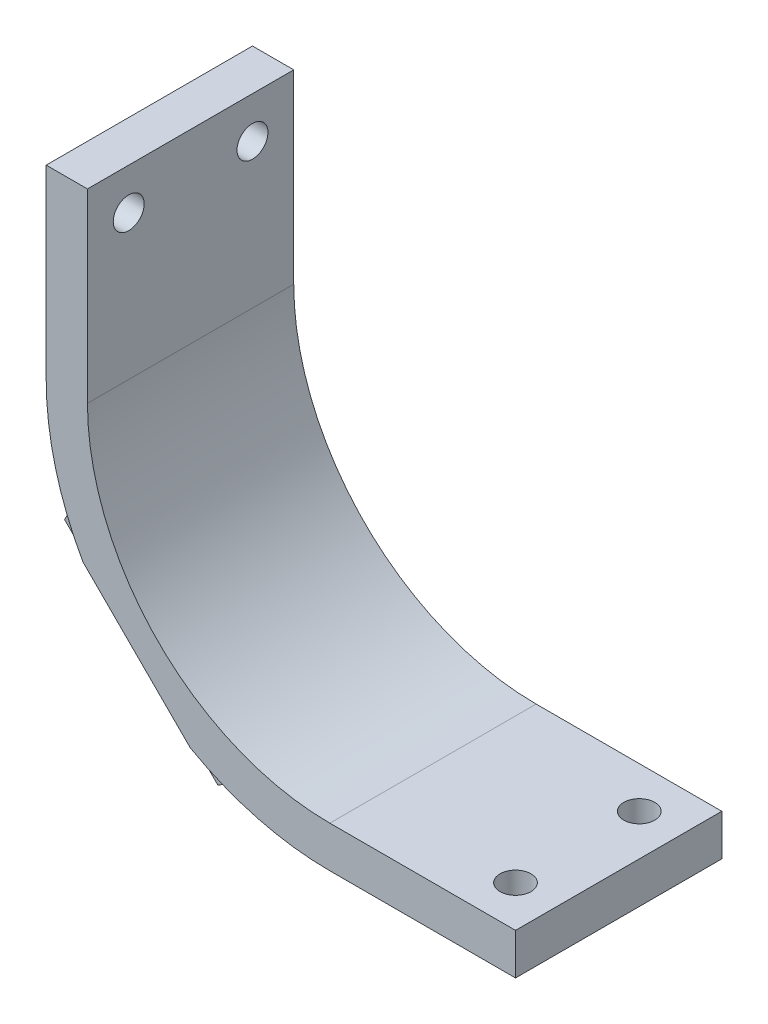
ISO-10303-21;
HEADER;
FILE_DESCRIPTION(('STEP AP214'),'2;1');
FILE_NAME('part.step','',(''),(''),'','','');
FILE_SCHEMA(('AUTOMOTIVE_DESIGN { 1 0 10303 214 1 1 1 1 }'));
ENDSEC;
DATA;
#1=APPLICATION_CONTEXT('core data for automotive mechanical design processes');
#2=APPLICATION_PROTOCOL_DEFINITION('international standard','automotive_design',2000,#1);
#3=PRODUCT_CONTEXT('',#1,'mechanical');
#4=PRODUCT('Part','Part','',(#3));
#5=PRODUCT_RELATED_PRODUCT_CATEGORY('part','',(#4));
#6=PRODUCT_DEFINITION_FORMATION('','',#4);
#7=PRODUCT_DEFINITION_CONTEXT('part definition',#1,'design');
#8=PRODUCT_DEFINITION('design','',#6,#7);
#9=PRODUCT_DEFINITION_SHAPE('','',#8);
#10=(LENGTH_UNIT() NAMED_UNIT(*) SI_UNIT(.MILLI.,.METRE.));
#11=(NAMED_UNIT(*) PLANE_ANGLE_UNIT() SI_UNIT($,.RADIAN.));
#12=(NAMED_UNIT(*) SI_UNIT($,.STERADIAN.) SOLID_ANGLE_UNIT());
#13=UNCERTAINTY_MEASURE_WITH_UNIT(LENGTH_MEASURE(1.E-05),#10,'distance_accuracy_value','');
#14=(GEOMETRIC_REPRESENTATION_CONTEXT(3) GLOBAL_UNCERTAINTY_ASSIGNED_CONTEXT((#13)) GLOBAL_UNIT_ASSIGNED_CONTEXT((#10,
#11,#12)) REPRESENTATION_CONTEXT('',''));
#15=CARTESIAN_POINT('',(0.,0.,0.));
#16=DIRECTION('',(0.,0.,1.));
#17=DIRECTION('',(1.,0.,0.));
#18=AXIS2_PLACEMENT_3D('',#15,#16,#17);
#19=CARTESIAN_POINT('',(47.,47.,40.));
#20=DIRECTION('',(0.,0.,-1.));
#21=DIRECTION('',(-1.,0.,0.));
#22=AXIS2_PLACEMENT_3D('',#19,#20,#21);
#23=CYLINDRICAL_SURFACE('',#22,55.);
#24=CARTESIAN_POINT('',(47.,47.,40.));
#25=DIRECTION('',(0.,0.,1.));
#26=DIRECTION('',(1.,0.,0.));
#27=AXIS2_PLACEMENT_3D('',#24,#25,#26);
#28=CIRCLE('',#27,55.);
#29=CARTESIAN_POINT('',(19.9156454425262,-0.868964248300269,40.));
#30=VERTEX_POINT('',#29);
#31=CARTESIAN_POINT('',(47.,-8.,40.));
#32=VERTEX_POINT('',#31);
#33=EDGE_CURVE('E253',#30,#32,#28,.T.);
#34=ORIENTED_EDGE('',*,*,#33,.F.);
#35=DIRECTION('',(0.,0.,-1.));
#36=VECTOR('',#35,1.);
#37=CARTESIAN_POINT('',(19.9156454425263,-0.868964248300295,40.));
#38=LINE('',#37,#36);
#39=CARTESIAN_POINT('',(19.9156454425262,-0.868964248300282,13.0000000000001));
#40=VERTEX_POINT('',#39);
#41=EDGE_CURVE('E184',#30,#40,#38,.T.);
#42=ORIENTED_EDGE('',*,*,#41,.T.);
#43=CARTESIAN_POINT('',(47.,47.,13.0000000000001));
#44=DIRECTION('',(0.,0.,-1.));
#45=DIRECTION('',(-1.,0.,0.));
#46=AXIS2_PLACEMENT_3D('',#43,#44,#45);
#47=CIRCLE('',#46,55.);
#48=CARTESIAN_POINT('',(47.,-8.,13.0000000000001));
#49=VERTEX_POINT('',#48);
#50=EDGE_CURVE('E304',#40,#49,#47,.F.);
#51=ORIENTED_EDGE('',*,*,#50,.T.);
#52=DIRECTION('',(0.,0.,-1.));
#53=VECTOR('',#52,1.);
#54=CARTESIAN_POINT('',(47.,-8.,40.));
#55=LINE('',#54,#53);
#56=EDGE_CURVE('E301',#32,#49,#55,.T.);
#57=ORIENTED_EDGE('',*,*,#56,.F.);
#58=EDGE_LOOP('',(#34,#42,#51,#57));
#59=FACE_BOUND('',#58,.T.);
#60=ADVANCED_FACE('F34',(#59),#23,.T.);
#61=CARTESIAN_POINT('',(47.,47.,13.0000000000001));
#62=DIRECTION('',(0.,0.,-1.));
#63=DIRECTION('',(-1.,0.,0.));
#64=AXIS2_PLACEMENT_3D('',#61,#62,#63);
#65=CONICAL_SURFACE('',#64,55.,0.785398163397444);
#66=CARTESIAN_POINT('',(47.,47.,8.));
#67=DIRECTION('',(0.,0.,-1.));
#68=DIRECTION('',(-1.,0.,0.));
#69=AXIS2_PLACEMENT_3D('',#66,#67,#68);
#70=CIRCLE('',#69,60.);
#71=CARTESIAN_POINT('',(-8.02785789808516,23.0848404741229,8.));
#72=VERTEX_POINT('',#71);
#73=CARTESIAN_POINT('',(-12.4166791817191,38.65384908975,8.));
#74=VERTEX_POINT('',#73);
#75=EDGE_CURVE('E308',#72,#74,#70,.T.);
#76=ORIENTED_EDGE('',*,*,#75,.F.);
#77=CARTESIAN_POINT('',(-8.02800990642339,23.0846884657847,7.9998));
#78=CARTESIAN_POINT('',(-7.69603661450025,23.4166617577078,8.43662037748966));
#79=CARTESIAN_POINT('',(-7.36378319515066,23.7489151770574,8.87301341968575));
#80=CARTESIAN_POINT('',(-6.6987160893605,24.4139822828476,9.74494484953542));
#81=CARTESIAN_POINT('',(-6.36590240289932,24.7467959693088,10.1804832371575));
#82=CARTESIAN_POINT('',(-6.03280858899107,25.079889783217,10.6155942894546));
#83=B_SPLINE_CURVE_WITH_KNOTS('',3,(#77,#78,#79,#80,#81,#82),.UNSPECIFIED.,.F.,.F.,(4,2,4),(0.,
1.923801447537,3.84760296587459),.UNSPECIFIED.);
#84=CARTESIAN_POINT('',(-6.03300858899107,25.079689783217,10.6153330583857));
#85=VERTEX_POINT('',#84);
#86=EDGE_CURVE('E11',#72,#85,#83,.T.);
#87=ORIENTED_EDGE('',*,*,#86,.T.);
#88=CARTESIAN_POINT('',(-32.6031163795725,51.6497975737985,-11.7388033194447));
#89=CARTESIAN_POINT('',(-32.0640904072059,51.1107716014319,-11.1692792117739));
#90=CARTESIAN_POINT('',(-31.523434261238,50.5701154554639,-10.6028292409363));
#91=CARTESIAN_POINT('',(-30.4385887826844,49.4852699769104,-9.47670280810827));
#92=CARTESIAN_POINT('',(-29.8943993720311,48.9410805662571,-8.9170264965704));
#93=CARTESIAN_POINT('',(-28.8020721211141,47.84875331534,-7.80492863635069));
#94=CARTESIAN_POINT('',(-28.2539331290096,47.3006143232355,-7.25250934864027));
#95=CARTESIAN_POINT('',(-27.1535847874001,46.2002659816261,-6.15584226000236));
#96=CARTESIAN_POINT('',(-26.6013754584182,45.6480566526442,-5.61159441791556));
#97=CARTESIAN_POINT('',(-25.487151272393,44.533832466619,-4.52681799322916));
#98=CARTESIAN_POINT('',(-24.9250933351123,43.9717745293382,-3.9863778398094));
#99=CARTESIAN_POINT('',(-23.7961668918426,42.8428480860685,-2.91564373066713));
#100=CARTESIAN_POINT('',(-23.2292984154502,42.2759796096761,-2.38534971258647));
#101=CARTESIAN_POINT('',(-22.0904139146043,41.1370951088303,-1.33603458546711));
#102=CARTESIAN_POINT('',(-21.5183982147383,40.5650794089642,-0.817012772544337));
#103=CARTESIAN_POINT('',(-20.3688033625842,39.4154845568101,0.20853521996653));
#104=CARTESIAN_POINT('',(-19.791224318911,38.8379055131369,0.715061642821188));
#105=CARTESIAN_POINT('',(-18.5984799718122,37.6451611660381,1.74140428688366));
#106=CARTESIAN_POINT('',(-17.982979822515,37.029661016741,2.26044351499154));
#107=CARTESIAN_POINT('',(-16.744816046082,35.791497240308,3.28117704252352));
#108=CARTESIAN_POINT('',(-16.1221523897576,35.1688335839836,3.78287127124005));
#109=CARTESIAN_POINT('',(-14.8690127209983,33.9156939152242,4.76685558098336));
#110=CARTESIAN_POINT('',(-14.2385350372513,33.2852162314773,5.24914141376239));
#111=CARTESIAN_POINT('',(-12.9694056522147,32.0160868464407,6.19171564118395));
#112=CARTESIAN_POINT('',(-12.3307540158984,31.3774352101243,6.65200421054131));
#113=CARTESIAN_POINT('',(-11.0472211779615,30.0939023721874,7.54609543564553));
#114=CARTESIAN_POINT('',(-10.4023728789115,29.4490540731374,7.9799921080813));
#115=CARTESIAN_POINT('',(-9.1037273058817,28.1504085001077,8.82003346191691));
#116=CARTESIAN_POINT('',(-8.44992975974284,27.4966109539688,9.22617729705363));
#117=CARTESIAN_POINT('',(-6.47516757696274,25.5218487711887,10.3974920887747));
#118=CARTESIAN_POINT('',(-5.13995178297837,24.1866329772043,11.1161703975154));
#119=CARTESIAN_POINT('',(-3.14941241288739,22.1960936071134,12.0582721611732));
#120=CARTESIAN_POINT('',(-2.50828573668544,21.5549669309114,12.3424931449902));
#121=CARTESIAN_POINT('',(-1.21817271561682,20.2648539098428,12.87288798258));
#122=CARTESIAN_POINT('',(-0.569186715612083,19.615867909838,13.1190634992864));
#123=CARTESIAN_POINT('',(0.736052472034867,18.3106287221911,13.5699358560089));
#124=CARTESIAN_POINT('',(1.39230649558333,17.6543746986426,13.7746278715835));
#125=CARTESIAN_POINT('',(2.71103610635231,16.3356450878736,14.1392641562665));
#126=CARTESIAN_POINT('',(3.37351169512802,15.6731694990979,14.2992084141892));
#127=CARTESIAN_POINT('',(4.69084996641715,14.3558312278088,14.568992498867));
#128=CARTESIAN_POINT('',(5.34562159760193,13.701059596624,14.6797178311156));
#129=CARTESIAN_POINT('',(6.65833612574721,12.3883450684788,14.8533863384364));
#130=CARTESIAN_POINT('',(7.31627898503298,11.730402209193,14.9163300797609));
#131=CARTESIAN_POINT('',(8.6335607759349,10.4131204182911,14.9932327749022));
#132=CARTESIAN_POINT('',(9.29289961730351,9.75378157692245,15.0071948040324));
#133=CARTESIAN_POINT('',(10.6111786778843,8.43550251634171,14.9858702361388));
#134=CARTESIAN_POINT('',(11.2701188959945,7.77656229823148,14.9505835035933));
#135=CARTESIAN_POINT('',(12.5853641779881,6.46131701623786,14.8314841555602));
#136=CARTESIAN_POINT('',(13.2416706666149,5.80501052761108,14.7477028323068));
#137=CARTESIAN_POINT('',(14.5504193597358,4.49626183449021,14.533206320363));
#138=CARTESIAN_POINT('',(15.2028615509743,3.8438196432517,14.402490970771));
#139=CARTESIAN_POINT('',(16.5025569914353,2.54412420279068,14.0964054891875));
#140=CARTESIAN_POINT('',(17.1498094859265,1.89687170829942,13.9210289794581));
#141=CARTESIAN_POINT('',(18.4379195085917,0.608761685634254,13.5284642291873));
#142=CARTESIAN_POINT('',(19.0787769727516,-0.0320957785256306,13.3112755705485));
#143=CARTESIAN_POINT('',(20.3651423751899,-1.31846118096395,12.8338456886665));
#144=CARTESIAN_POINT('',(21.0105151596011,-1.96383396537509,12.5728789326895));
#145=CARTESIAN_POINT('',(22.2932907376685,-3.24660954344254,12.0143022460322));
#146=CARTESIAN_POINT('',(22.9306930559293,-3.88401186170331,11.7166901410286));
#147=CARTESIAN_POINT('',(24.1971649820708,-5.1504837878448,11.0883232832366));
#148=CARTESIAN_POINT('',(24.8262355836341,-5.7795543894081,10.7575725237734));
#149=CARTESIAN_POINT('',(26.076092968643,-7.02941177441705,10.0661949575039));
#150=CARTESIAN_POINT('',(26.6968795359541,-7.65019834172814,9.70556737295925));
#151=CARTESIAN_POINT('',(28.4363099284002,-9.38962873417419,8.65067817098942));
#152=CARTESIAN_POINT('',(29.5455870289438,-10.4989058347178,7.92541817562292));
#153=CARTESIAN_POINT('',(31.7390513972084,-12.6923702029824,6.40252232829223));
#154=CARTESIAN_POINT('',(32.8232329381816,-13.7765517439557,5.60487015702447));
#155=CARTESIAN_POINT('',(34.9705153850231,-15.9238341907972,3.94927936246574));
#156=CARTESIAN_POINT('',(36.0335791612341,-16.9868979670081,3.09124485488133));
#157=CARTESIAN_POINT('',(38.1392646440706,-19.0925834498446,1.32688858141707));
#158=CARTESIAN_POINT('',(39.1818880226671,-20.1352068284411,0.420570787717988));
#159=CARTESIAN_POINT('',(41.198023451476,-22.15134225725,-1.38599371980204));
#160=CARTESIAN_POINT('',(42.172400444719,-23.125719250493,-2.28431686551629));
#161=CARTESIAN_POINT('',(44.1069418778061,-25.0602606835802,-4.11112352728949));
#162=CARTESIAN_POINT('',(45.0671056746427,-26.0204244804168,-5.03960840183673));
#163=CARTESIAN_POINT('',(46.9706855674543,-27.9240043732283,-6.91783234761778));
#164=CARTESIAN_POINT('',(47.9141567726069,-28.8674755783809,-7.867459896317));
#165=CARTESIAN_POINT('',(49.3210494636857,-30.2743682694597,-9.30786712267713));
#166=CARTESIAN_POINT('',(49.7885920681769,-30.7419108739509,-9.79062578750839));
#167=CARTESIAN_POINT('',(50.721091178109,-31.674409983883,-10.7610953996489));
#168=CARTESIAN_POINT('',(51.1860477181062,-32.1393665238802,-11.248806280537));
#169=CARTESIAN_POINT('',(51.6497975737985,-32.6031163795725,-11.7388033194447));
#170=B_SPLINE_CURVE_WITH_KNOTS('',3,(#88,#89,#90,#91,#92,#93,#94,#95,#96,#97,#98,#99,#100,#101,
#102,#103,#104,#105,#106,#107,#108,#109,#110,#111,#112,#113,#114,#115,#116,#117,#118,#119,#120,
#121,#122,#123,#124,#125,#126,#127,#128,#129,#130,#131,#132,#133,#134,#135,#136,#137,#138,#139,
#140,#141,#142,#143,#144,#145,#146,#147,#148,#149,#150,#151,#152,#153,#154,#155,#156,#157,#158,
#159,#160,#161,#162,#163,#164,#165,#166,#167,#168,#169),.UNSPECIFIED.,.F.,.F.,(4,2,2,2,2,2,2,2,
2,2,2,2,2,2,2,2,2,2,2,2,2,2,2,2,2,2,2,2,2,2,2,2,2,2,2,2,2,2,2,2,4),(0.,2.854665627318,
5.70939454482451,8.56499272833419,11.4205765234581,14.3040876074017,17.1875809635913,
20.0708937415538,22.9541503413566,25.9943225502353,29.0345071510345,32.0753536291279,
35.1161759510678,38.1454409279422,41.1747982345577,47.229336758417,50.079275638274,
52.9290899145731,55.7792354281715,58.6293816542353,61.425940419648,64.2224660429604,
67.0188160834684,69.8151738189271,72.6097291495406,75.4042940606901,78.1992582674927,
80.9942504237806,83.8412209326692,86.6883604458117,89.5351572802687,92.3820282444118,
97.5643879281655,102.747918782292,107.939875130006,113.131405002251,118.065744391249,
123.000306332536,127.913151404862,130.369192994932,132.825201686932),.UNSPECIFIED.);
#171=CARTESIAN_POINT('',(-0.868964248300283,19.9156454425262,13.0000000000001));
#172=VERTEX_POINT('',#171);
#173=EDGE_CURVE('E44',#85,#172,#170,.T.);
#174=ORIENTED_EDGE('',*,*,#173,.T.);
#175=CARTESIAN_POINT('',(-8.,47.,13.0000000000001));
#176=VERTEX_POINT('',#175);
#177=EDGE_CURVE('E305',#176,#172,#47,.F.);
#178=ORIENTED_EDGE('',*,*,#177,.F.);
#179=CARTESIAN_POINT('',(-12.4166791817191,38.65384908975,8.));
#180=CARTESIAN_POINT('',(-12.0571719483686,39.3332060227347,8.45047450478482));
#181=CARTESIAN_POINT('',(-11.6956859904717,40.0163021301069,8.89380872091933));
#182=CARTESIAN_POINT('',(-10.9686773957215,41.3901224134429,9.76407680964662));
#183=CARTESIAN_POINT('',(-10.603157014587,42.0808423267993,10.1910193029875));
#184=CARTESIAN_POINT('',(-9.86759038414573,43.470834637678,11.0268994642175));
#185=CARTESIAN_POINT('',(-9.49754380373565,44.1701076608823,11.4358358047221));
#186=CARTESIAN_POINT('',(-8.75250109029604,45.5780068233768,12.2336202180553));
#187=CARTESIAN_POINT('',(-8.37750242052765,46.2866377563149,12.622457450749));
#188=CARTESIAN_POINT('',(-8.,47.,13.0000000000001));
#189=B_SPLINE_CURVE_WITH_KNOTS('',3,(#179,#180,#181,#182,#183,#184,#185,#186,#187,#188),
.UNSPECIFIED.,.F.,.F.,(4,2,2,2,4),(0.,2.67271079094445,5.34399613576452,8.01547807484035,
10.6883861152924),.UNSPECIFIED.);
#190=EDGE_CURVE('E315',#74,#176,#189,.T.);
#191=ORIENTED_EDGE('',*,*,#190,.F.);
#192=EDGE_LOOP('',(#76,#87,#174,#178,#191));
#193=FACE_BOUND('',#192,.T.);
#194=ADVANCED_FACE('F365',(#193),#65,.T.);
#195=ORIENTED_EDGE('',*,*,#177,.T.);
#196=DIRECTION('',(0.,0.,-1.));
#197=VECTOR('',#196,1.);
#198=CARTESIAN_POINT('',(-0.868964248300295,19.9156454425263,40.));
#199=LINE('',#198,#197);
#200=CARTESIAN_POINT('',(-0.868964248300262,19.9156454425262,40.));
#201=VERTEX_POINT('',#200);
#202=EDGE_CURVE('E188',#172,#201,#199,.F.);
#203=ORIENTED_EDGE('',*,*,#202,.T.);
#204=CARTESIAN_POINT('',(-8.,47.,40.));
#205=VERTEX_POINT('',#204);
#206=EDGE_CURVE('E249',#205,#201,#28,.T.);
#207=ORIENTED_EDGE('',*,*,#206,.F.);
#208=DIRECTION('',(0.,0.,-1.));
#209=VECTOR('',#208,1.);
#210=CARTESIAN_POINT('',(-8.,47.,40.));
#211=LINE('',#210,#209);
#212=EDGE_CURVE('E267',#205,#176,#211,.T.);
#213=ORIENTED_EDGE('',*,*,#212,.T.);
#214=EDGE_LOOP('',(#195,#203,#207,#213));
#215=FACE_BOUND('',#214,.T.);
#216=ADVANCED_FACE('F362',(#215),#23,.T.);
#217=CARTESIAN_POINT('',(47.,-8.,40.));
#218=DIRECTION('',(0.,1.,0.));
#219=DIRECTION('',(0.,0.,1.));
#220=AXIS2_PLACEMENT_3D('',#217,#218,#219);
#221=PLANE('',#220);
#222=CARTESIAN_POINT('',(75.,-8.,32.));
#223=DIRECTION('',(0.,-1.,0.));
#224=DIRECTION('',(0.,0.,-1.));
#225=AXIS2_PLACEMENT_3D('',#222,#223,#224);
#226=CIRCLE('',#225,3.00000000000001);
#227=CARTESIAN_POINT('',(75.,-8.,29.));
#228=VERTEX_POINT('',#227);
#229=EDGE_CURVE('E682',#228,#228,#226,.T.);
#230=ORIENTED_EDGE('',*,*,#229,.F.);
#231=EDGE_LOOP('',(#230));
#232=FACE_BOUND('',#231,.T.);
#233=CARTESIAN_POINT('',(75.,-8.,8.));
#234=DIRECTION('',(0.,-1.,0.));
#235=DIRECTION('',(0.,0.,-1.));
#236=AXIS2_PLACEMENT_3D('',#233,#234,#235);
#237=CIRCLE('',#236,3.00000000000001);
#238=CARTESIAN_POINT('',(75.,-8.,4.99999999999999));
#239=VERTEX_POINT('',#238);
#240=EDGE_CURVE('E684',#239,#239,#237,.T.);
#241=ORIENTED_EDGE('',*,*,#240,.F.);
#242=EDGE_LOOP('',(#241));
#243=FACE_BOUND('',#242,.T.);
#244=DIRECTION('',(1.,0.,0.));
#245=VECTOR('',#244,1.);
#246=CARTESIAN_POINT('',(47.,-8.,0.));
#247=LINE('',#246,#245);
#248=CARTESIAN_POINT('',(47.,-8.,0.));
#249=VERTEX_POINT('',#248);
#250=CARTESIAN_POINT('',(83.,-8.,0.));
#251=VERTEX_POINT('',#250);
#252=EDGE_CURVE('E242',#249,#251,#247,.T.);
#253=ORIENTED_EDGE('',*,*,#252,.T.);
#254=DIRECTION('',(0.,0.,-1.));
#255=VECTOR('',#254,1.);
#256=CARTESIAN_POINT('',(83.,-8.,40.));
#257=LINE('',#256,#255);
#258=CARTESIAN_POINT('',(83.,-8.,40.));
#259=VERTEX_POINT('',#258);
#260=EDGE_CURVE('E298',#259,#251,#257,.T.);
#261=ORIENTED_EDGE('',*,*,#260,.F.);
#262=DIRECTION('',(1.,0.,0.));
#263=VECTOR('',#262,1.);
#264=CARTESIAN_POINT('',(47.,-8.,40.));
#265=LINE('',#264,#263);
#266=EDGE_CURVE('E252',#32,#259,#265,.T.);
#267=ORIENTED_EDGE('',*,*,#266,.F.);
#268=ORIENTED_EDGE('',*,*,#56,.T.);
#269=DIRECTION('',(0.,0.,-1.));
#270=VECTOR('',#269,1.);
#271=CARTESIAN_POINT('',(47.,-8.,8.));
#272=LINE('',#271,#270);
#273=EDGE_CURVE('E231',#49,#249,#272,.T.);
#274=ORIENTED_EDGE('',*,*,#273,.T.);
#275=EDGE_LOOP('',(#253,#261,#267,#268,#274));
#276=FACE_BOUND('',#275,.T.);
#277=ADVANCED_FACE('F359',(#232,#243,#276),#221,.F.);
#278=CARTESIAN_POINT('',(83.,0.,40.));
#279=DIRECTION('',(-1.,0.,0.));
#280=DIRECTION('',(0.,0.,1.));
#281=AXIS2_PLACEMENT_3D('',#278,#279,#280);
#282=PLANE('',#281);
#283=DIRECTION('',(0.,1.,0.));
#284=VECTOR('',#283,1.);
#285=CARTESIAN_POINT('',(83.,0.,0.));
#286=LINE('',#285,#284);
#287=CARTESIAN_POINT('',(83.,0.,0.));
#288=VERTEX_POINT('',#287);
#289=EDGE_CURVE('E269',#251,#288,#286,.T.);
#290=ORIENTED_EDGE('',*,*,#289,.T.);
#291=DIRECTION('',(0.,0.,-1.));
#292=VECTOR('',#291,1.);
#293=CARTESIAN_POINT('',(83.,0.,40.));
#294=LINE('',#293,#292);
#295=CARTESIAN_POINT('',(83.,0.,40.));
#296=VERTEX_POINT('',#295);
#297=EDGE_CURVE('E295',#296,#288,#294,.T.);
#298=ORIENTED_EDGE('',*,*,#297,.F.);
#299=DIRECTION('',(0.,1.,0.));
#300=VECTOR('',#299,1.);
#301=CARTESIAN_POINT('',(83.,0.,40.));
#302=LINE('',#301,#300);
#303=EDGE_CURVE('E255',#259,#296,#302,.T.);
#304=ORIENTED_EDGE('',*,*,#303,.F.);
#305=ORIENTED_EDGE('',*,*,#260,.T.);
#306=EDGE_LOOP('',(#290,#298,#304,#305));
#307=FACE_BOUND('',#306,.T.);
#308=ADVANCED_FACE('F355',(#307),#282,.F.);
#309=CARTESIAN_POINT('',(47.,0.,40.));
#310=DIRECTION('',(0.,-1.,0.));
#311=DIRECTION('',(0.,0.,-1.));
#312=AXIS2_PLACEMENT_3D('',#309,#310,#311);
#313=PLANE('',#312);
#314=CARTESIAN_POINT('',(75.,0.,32.));
#315=DIRECTION('',(0.,-1.,0.));
#316=DIRECTION('',(0.,0.,-1.));
#317=AXIS2_PLACEMENT_3D('',#314,#315,#316);
#318=CIRCLE('',#317,3.00000000000001);
#319=CARTESIAN_POINT('',(75.,0.,29.));
#320=VERTEX_POINT('',#319);
#321=EDGE_CURVE('E39',#320,#320,#318,.T.);
#322=ORIENTED_EDGE('',*,*,#321,.T.);
#323=EDGE_LOOP('',(#322));
#324=FACE_BOUND('',#323,.T.);
#325=CARTESIAN_POINT('',(75.,0.,8.));
#326=DIRECTION('',(0.,-1.,0.));
#327=DIRECTION('',(0.,0.,-1.));
#328=AXIS2_PLACEMENT_3D('',#325,#326,#327);
#329=CIRCLE('',#328,3.00000000000001);
#330=CARTESIAN_POINT('',(75.,0.,4.99999999999999));
#331=VERTEX_POINT('',#330);
#332=EDGE_CURVE('E183',#331,#331,#329,.T.);
#333=ORIENTED_EDGE('',*,*,#332,.T.);
#334=EDGE_LOOP('',(#333));
#335=FACE_BOUND('',#334,.T.);
#336=DIRECTION('',(-1.,0.,0.));
#337=VECTOR('',#336,1.);
#338=CARTESIAN_POINT('',(47.,0.,0.));
#339=LINE('',#338,#337);
#340=CARTESIAN_POINT('',(47.,0.,0.));
#341=VERTEX_POINT('',#340);
#342=EDGE_CURVE('E271',#288,#341,#339,.T.);
#343=ORIENTED_EDGE('',*,*,#342,.T.);
#344=DIRECTION('',(0.,0.,-1.));
#345=VECTOR('',#344,1.);
#346=CARTESIAN_POINT('',(47.,0.,40.));
#347=LINE('',#346,#345);
#348=CARTESIAN_POINT('',(47.,0.,40.));
#349=VERTEX_POINT('',#348);
#350=EDGE_CURVE('E292',#349,#341,#347,.T.);
#351=ORIENTED_EDGE('',*,*,#350,.F.);
#352=DIRECTION('',(-1.,0.,0.));
#353=VECTOR('',#352,1.);
#354=CARTESIAN_POINT('',(47.,0.,40.));
#355=LINE('',#354,#353);
#356=EDGE_CURVE('E257',#296,#349,#355,.T.);
#357=ORIENTED_EDGE('',*,*,#356,.F.);
#358=ORIENTED_EDGE('',*,*,#297,.T.);
#359=EDGE_LOOP('',(#343,#351,#357,#358));
#360=FACE_BOUND('',#359,.T.);
#361=ADVANCED_FACE('F351',(#324,#335,#360),#313,.F.);
#362=CARTESIAN_POINT('',(47.,47.,40.));
#363=DIRECTION('',(0.,0.,-1.));
#364=DIRECTION('',(-1.,0.,0.));
#365=AXIS2_PLACEMENT_3D('',#362,#363,#364);
#366=CYLINDRICAL_SURFACE('',#365,47.);
#367=CARTESIAN_POINT('',(47.,47.,0.));
#368=DIRECTION('',(0.,0.,-1.));
#369=DIRECTION('',(1.,0.,0.));
#370=AXIS2_PLACEMENT_3D('',#367,#368,#369);
#371=CIRCLE('',#370,47.);
#372=CARTESIAN_POINT('',(0.,47.,0.));
#373=VERTEX_POINT('',#372);
#374=EDGE_CURVE('E273',#341,#373,#371,.T.);
#375=ORIENTED_EDGE('',*,*,#374,.T.);
#376=DIRECTION('',(0.,0.,-1.));
#377=VECTOR('',#376,1.);
#378=CARTESIAN_POINT('',(0.,47.,40.));
#379=LINE('',#378,#377);
#380=CARTESIAN_POINT('',(0.,47.,40.));
#381=VERTEX_POINT('',#380);
#382=EDGE_CURVE('E289',#381,#373,#379,.T.);
#383=ORIENTED_EDGE('',*,*,#382,.F.);
#384=CARTESIAN_POINT('',(47.,47.,40.));
#385=DIRECTION('',(0.,0.,-1.));
#386=DIRECTION('',(1.,0.,0.));
#387=AXIS2_PLACEMENT_3D('',#384,#385,#386);
#388=CIRCLE('',#387,47.);
#389=EDGE_CURVE('E259',#349,#381,#388,.T.);
#390=ORIENTED_EDGE('',*,*,#389,.F.);
#391=ORIENTED_EDGE('',*,*,#350,.T.);
#392=EDGE_LOOP('',(#375,#383,#390,#391));
#393=FACE_BOUND('',#392,.T.);
#394=ADVANCED_FACE('F347',(#393),#366,.F.);
#395=CARTESIAN_POINT('',(0.,47.,40.));
#396=DIRECTION('',(-1.,0.,0.));
#397=DIRECTION('',(0.,0.,1.));
#398=AXIS2_PLACEMENT_3D('',#395,#396,#397);
#399=PLANE('',#398);
#400=CARTESIAN_POINT('',(0.,75.,32.));
#401=DIRECTION('',(-1.,0.,0.));
#402=DIRECTION('',(0.,0.,1.));
#403=AXIS2_PLACEMENT_3D('',#400,#401,#402);
#404=CIRCLE('',#403,3.);
#405=CARTESIAN_POINT('',(0.,75.,35.));
#406=VERTEX_POINT('',#405);
#407=EDGE_CURVE('E672',#406,#406,#404,.T.);
#408=ORIENTED_EDGE('',*,*,#407,.T.);
#409=EDGE_LOOP('',(#408));
#410=FACE_BOUND('',#409,.T.);
#411=CARTESIAN_POINT('',(0.,75.,8.));
#412=DIRECTION('',(-1.,0.,0.));
#413=DIRECTION('',(0.,0.,1.));
#414=AXIS2_PLACEMENT_3D('',#411,#412,#413);
#415=CIRCLE('',#414,3.);
#416=CARTESIAN_POINT('',(0.,75.,11.));
#417=VERTEX_POINT('',#416);
#418=EDGE_CURVE('E676',#417,#417,#415,.T.);
#419=ORIENTED_EDGE('',*,*,#418,.T.);
#420=EDGE_LOOP('',(#419));
#421=FACE_BOUND('',#420,.T.);
#422=DIRECTION('',(0.,1.,0.));
#423=VECTOR('',#422,1.);
#424=CARTESIAN_POINT('',(0.,47.,0.));
#425=LINE('',#424,#423);
#426=CARTESIAN_POINT('',(0.,83.,0.));
#427=VERTEX_POINT('',#426);
#428=EDGE_CURVE('E275',#373,#427,#425,.T.);
#429=ORIENTED_EDGE('',*,*,#428,.T.);
#430=DIRECTION('',(0.,0.,-1.));
#431=VECTOR('',#430,1.);
#432=CARTESIAN_POINT('',(0.,83.,40.));
#433=LINE('',#432,#431);
#434=CARTESIAN_POINT('',(0.,83.,40.));
#435=VERTEX_POINT('',#434);
#436=EDGE_CURVE('E286',#435,#427,#433,.T.);
#437=ORIENTED_EDGE('',*,*,#436,.F.);
#438=DIRECTION('',(0.,1.,0.));
#439=VECTOR('',#438,1.);
#440=CARTESIAN_POINT('',(0.,47.,40.));
#441=LINE('',#440,#439);
#442=EDGE_CURVE('E261',#381,#435,#441,.T.);
#443=ORIENTED_EDGE('',*,*,#442,.F.);
#444=ORIENTED_EDGE('',*,*,#382,.T.);
#445=EDGE_LOOP('',(#429,#437,#443,#444));
#446=FACE_BOUND('',#445,.T.);
#447=ADVANCED_FACE('F343',(#410,#421,#446),#399,.F.);
#448=CARTESIAN_POINT('',(0.,83.,40.));
#449=DIRECTION('',(0.,-1.,0.));
#450=DIRECTION('',(0.,0.,-1.));
#451=AXIS2_PLACEMENT_3D('',#448,#449,#450);
#452=PLANE('',#451);
#453=DIRECTION('',(-1.,0.,0.));
#454=VECTOR('',#453,1.);
#455=CARTESIAN_POINT('',(0.,83.,0.));
#456=LINE('',#455,#454);
#457=CARTESIAN_POINT('',(-8.,83.,0.));
#458=VERTEX_POINT('',#457);
#459=EDGE_CURVE('E277',#427,#458,#456,.T.);
#460=ORIENTED_EDGE('',*,*,#459,.T.);
#461=DIRECTION('',(0.,0.,-1.));
#462=VECTOR('',#461,1.);
#463=CARTESIAN_POINT('',(-8.,83.,40.));
#464=LINE('',#463,#462);
#465=CARTESIAN_POINT('',(-8.,83.,40.));
#466=VERTEX_POINT('',#465);
#467=EDGE_CURVE('E283',#466,#458,#464,.T.);
#468=ORIENTED_EDGE('',*,*,#467,.F.);
#469=DIRECTION('',(-1.,0.,0.));
#470=VECTOR('',#469,1.);
#471=CARTESIAN_POINT('',(0.,83.,40.));
#472=LINE('',#471,#470);
#473=EDGE_CURVE('E263',#435,#466,#472,.T.);
#474=ORIENTED_EDGE('',*,*,#473,.F.);
#475=ORIENTED_EDGE('',*,*,#436,.T.);
#476=EDGE_LOOP('',(#460,#468,#474,#475));
#477=FACE_BOUND('',#476,.T.);
#478=ADVANCED_FACE('F339',(#477),#452,.F.);
#479=CARTESIAN_POINT('',(-8.,83.,40.));
#480=DIRECTION('',(1.,0.,0.));
#481=DIRECTION('',(0.,0.,-1.));
#482=AXIS2_PLACEMENT_3D('',#479,#480,#481);
#483=PLANE('',#482);
#484=CARTESIAN_POINT('',(-8.,75.,32.));
#485=DIRECTION('',(-1.,0.,0.));
#486=DIRECTION('',(0.,0.,-1.));
#487=AXIS2_PLACEMENT_3D('',#484,#485,#486);
#488=CIRCLE('',#487,3.);
#489=CARTESIAN_POINT('',(-8.,75.,29.));
#490=VERTEX_POINT('',#489);
#491=EDGE_CURVE('E669',#490,#490,#488,.T.);
#492=ORIENTED_EDGE('',*,*,#491,.F.);
#493=EDGE_LOOP('',(#492));
#494=FACE_BOUND('',#493,.T.);
#495=CARTESIAN_POINT('',(-8.,75.,8.));
#496=DIRECTION('',(-1.,0.,0.));
#497=DIRECTION('',(0.,0.,1.));
#498=AXIS2_PLACEMENT_3D('',#495,#496,#497);
#499=CIRCLE('',#498,3.);
#500=CARTESIAN_POINT('',(-8.,75.,11.));
#501=VERTEX_POINT('',#500);
#502=EDGE_CURVE('E673',#501,#501,#499,.T.);
#503=ORIENTED_EDGE('',*,*,#502,.F.);
#504=EDGE_LOOP('',(#503));
#505=FACE_BOUND('',#504,.T.);
#506=DIRECTION('',(0.,-1.,0.));
#507=VECTOR('',#506,1.);
#508=CARTESIAN_POINT('',(-8.,83.,0.));
#509=LINE('',#508,#507);
#510=CARTESIAN_POINT('',(-8.,47.,0.));
#511=VERTEX_POINT('',#510);
#512=EDGE_CURVE('E279',#458,#511,#509,.T.);
#513=ORIENTED_EDGE('',*,*,#512,.T.);
#514=DIRECTION('',(0.,0.,-1.));
#515=VECTOR('',#514,1.);
#516=CARTESIAN_POINT('',(-8.,47.,8.));
#517=LINE('',#516,#515);
#518=EDGE_CURVE('E239',#176,#511,#517,.T.);
#519=ORIENTED_EDGE('',*,*,#518,.F.);
#520=ORIENTED_EDGE('',*,*,#212,.F.);
#521=DIRECTION('',(0.,-1.,0.));
#522=VECTOR('',#521,1.);
#523=CARTESIAN_POINT('',(-8.,83.,40.));
#524=LINE('',#523,#522);
#525=EDGE_CURVE('E265',#466,#205,#524,.T.);
#526=ORIENTED_EDGE('',*,*,#525,.F.);
#527=ORIENTED_EDGE('',*,*,#467,.T.);
#528=EDGE_LOOP('',(#513,#519,#520,#526,#527));
#529=FACE_BOUND('',#528,.T.);
#530=ADVANCED_FACE('F331',(#494,#505,#529),#483,.F.);
#531=CARTESIAN_POINT('',(47.,47.,40.));
#532=DIRECTION('',(0.,0.,1.));
#533=DIRECTION('',(1.,0.,0.));
#534=AXIS2_PLACEMENT_3D('',#531,#532,#533);
#535=PLANE('',#534);
#536=DIRECTION('',(-0.707106781186548,0.707106781186548,0.));
#537=VECTOR('',#536,1.);
#538=CARTESIAN_POINT('',(-6.03300858899107,25.079689783217,40.));
#539=LINE('',#538,#537);
#540=EDGE_CURVE('E166',#30,#201,#539,.T.);
#541=ORIENTED_EDGE('',*,*,#540,.F.);
#542=ORIENTED_EDGE('',*,*,#33,.T.);
#543=ORIENTED_EDGE('',*,*,#266,.T.);
#544=ORIENTED_EDGE('',*,*,#303,.T.);
#545=ORIENTED_EDGE('',*,*,#356,.T.);
#546=ORIENTED_EDGE('',*,*,#389,.T.);
#547=ORIENTED_EDGE('',*,*,#442,.T.);
#548=ORIENTED_EDGE('',*,*,#473,.T.);
#549=ORIENTED_EDGE('',*,*,#525,.T.);
#550=ORIENTED_EDGE('',*,*,#206,.T.);
#551=EDGE_LOOP('',(#541,#542,#543,#544,#545,#546,#547,#548,#549,#550));
#552=FACE_BOUND('',#551,.T.);
#553=ADVANCED_FACE('F327',(#552),#535,.T.);
#554=CARTESIAN_POINT('',(47.,47.,0.));
#555=DIRECTION('',(0.,0.,1.));
#556=DIRECTION('',(1.,0.,0.));
#557=AXIS2_PLACEMENT_3D('',#554,#555,#556);
#558=PLANE('',#557);
#559=ORIENTED_EDGE('',*,*,#252,.F.);
#560=DIRECTION('',(-0.883869850205738,-0.467732923683255,0.));
#561=VECTOR('',#560,1.);
#562=CARTESIAN_POINT('',(47.,-8.,0.));
#563=LINE('',#562,#561);
#564=CARTESIAN_POINT('',(-6.74011537017762,-36.4386001800126,0.));
#565=VERTEX_POINT('',#564);
#566=EDGE_CURVE('E219',#249,#565,#563,.T.);
#567=ORIENTED_EDGE('',*,*,#566,.T.);
#568=DIRECTION('',(-0.707106781186547,0.707106781186548,0.));
#569=VECTOR('',#568,1.);
#570=CARTESIAN_POINT('',(-6.74011537017762,-36.4386001800126,0.));
#571=LINE('',#570,#569);
#572=CARTESIAN_POINT('',(-36.4386001800126,-6.7401153701776,0.));
#573=VERTEX_POINT('',#572);
#574=EDGE_CURVE('E234',#565,#573,#571,.T.);
#575=ORIENTED_EDGE('',*,*,#574,.T.);
#576=DIRECTION('',(0.467732923683255,0.883869850205738,0.));
#577=VECTOR('',#576,1.);
#578=CARTESIAN_POINT('',(-8.,47.,0.));
#579=LINE('',#578,#577);
#580=EDGE_CURVE('E225',#573,#511,#579,.T.);
#581=ORIENTED_EDGE('',*,*,#580,.T.);
#582=ORIENTED_EDGE('',*,*,#512,.F.);
#583=ORIENTED_EDGE('',*,*,#459,.F.);
#584=ORIENTED_EDGE('',*,*,#428,.F.);
#585=ORIENTED_EDGE('',*,*,#374,.F.);
#586=ORIENTED_EDGE('',*,*,#342,.F.);
#587=ORIENTED_EDGE('',*,*,#289,.F.);
#588=EDGE_LOOP('',(#559,#567,#575,#581,#582,#583,#584,#585,#586,#587));
#589=FACE_BOUND('',#588,.T.);
#590=CARTESIAN_POINT('',(-28.6604255869606,-6.7401153701776,0.));
#591=DIRECTION('',(0.,0.,-1.));
#592=DIRECTION('',(-1.,0.,0.));
#593=AXIS2_PLACEMENT_3D('',#590,#591,#592);
#594=CIRCLE('',#593,1.8);
#595=CARTESIAN_POINT('',(-30.4604255869606,-6.7401153701776,0.));
#596=VERTEX_POINT('',#595);
#597=EDGE_CURVE('E191',#596,#596,#594,.T.);
#598=ORIENTED_EDGE('',*,*,#597,.F.);
#599=EDGE_LOOP('',(#598));
#600=FACE_BOUND('',#599,.T.);
#601=CARTESIAN_POINT('',(-6.74011537017762,-28.6604255869606,0.));
#602=DIRECTION('',(0.,0.,-1.));
#603=DIRECTION('',(-1.,0.,0.));
#604=AXIS2_PLACEMENT_3D('',#601,#602,#603);
#605=CIRCLE('',#604,1.8);
#606=CARTESIAN_POINT('',(-8.54011537017762,-28.6604255869606,0.));
#607=VERTEX_POINT('',#606);
#608=EDGE_CURVE('E195',#607,#607,#605,.T.);
#609=ORIENTED_EDGE('',*,*,#608,.F.);
#610=EDGE_LOOP('',(#609));
#611=FACE_BOUND('',#610,.T.);
#612=CARTESIAN_POINT('',(-6.74011537017761,15.1801948466053,0.));
#613=DIRECTION('',(0.,0.,-1.));
#614=DIRECTION('',(-1.,0.,0.));
#615=AXIS2_PLACEMENT_3D('',#612,#613,#614);
#616=CIRCLE('',#615,1.8);
#617=CARTESIAN_POINT('',(-8.5401153701776,15.1801948466053,0.));
#618=VERTEX_POINT('',#617);
#619=EDGE_CURVE('E201',#618,#618,#616,.T.);
#620=ORIENTED_EDGE('',*,*,#619,.F.);
#621=EDGE_LOOP('',(#620));
#622=FACE_BOUND('',#621,.T.);
#623=CARTESIAN_POINT('',(15.1801948466053,-6.74011537017761,0.));
#624=DIRECTION('',(0.,0.,-1.));
#625=DIRECTION('',(-1.,0.,0.));
#626=AXIS2_PLACEMENT_3D('',#623,#624,#625);
#627=CIRCLE('',#626,1.8);
#628=CARTESIAN_POINT('',(13.3801948466053,-6.74011537017761,0.));
#629=VERTEX_POINT('',#628);
#630=EDGE_CURVE('E207',#629,#629,#627,.T.);
#631=ORIENTED_EDGE('',*,*,#630,.F.);
#632=EDGE_LOOP('',(#631));
#633=FACE_BOUND('',#632,.T.);
#634=CARTESIAN_POINT('',(-6.74011537017761,-6.7401153701776,0.));
#635=DIRECTION('',(0.,0.,-1.));
#636=DIRECTION('',(-1.,0.,0.));
#637=AXIS2_PLACEMENT_3D('',#634,#635,#636);
#638=CIRCLE('',#637,11.5);
#639=CARTESIAN_POINT('',(-18.2401153701776,-6.7401153701776,0.));
#640=VERTEX_POINT('',#639);
#641=EDGE_CURVE('E213',#640,#640,#638,.T.);
#642=ORIENTED_EDGE('',*,*,#641,.F.);
#643=EDGE_LOOP('',(#642));
#644=FACE_BOUND('',#643,.T.);
#645=ADVANCED_FACE('F330',(#589,#600,#611,#622,#633,#644),#558,.F.);
#646=CARTESIAN_POINT('',(-8.,47.,8.));
#647=DIRECTION('',(-0.883869850205738,0.467732923683255,0.));
#648=DIRECTION('',(-0.467732923683255,-0.883869850205738,0.));
#649=AXIS2_PLACEMENT_3D('',#646,#647,#648);
#650=PLANE('',#649);
#651=ORIENTED_EDGE('',*,*,#580,.F.);
#652=DIRECTION('',(0.,0.,-1.));
#653=VECTOR('',#652,1.);
#654=CARTESIAN_POINT('',(-36.4386001800126,-6.7401153701776,8.));
#655=LINE('',#654,#653);
#656=CARTESIAN_POINT('',(-36.4386001800126,-6.7401153701776,8.));
#657=VERTEX_POINT('',#656);
#658=EDGE_CURVE('E243',#657,#573,#655,.T.);
#659=ORIENTED_EDGE('',*,*,#658,.F.);
#660=DIRECTION('',(0.467732923683255,0.883869850205738,0.));
#661=VECTOR('',#660,1.);
#662=CARTESIAN_POINT('',(-8.,47.,8.));
#663=LINE('',#662,#661);
#664=EDGE_CURVE('E228',#657,#74,#663,.T.);
#665=ORIENTED_EDGE('',*,*,#664,.T.);
#666=ORIENTED_EDGE('',*,*,#190,.T.);
#667=ORIENTED_EDGE('',*,*,#518,.T.);
#668=EDGE_LOOP('',(#651,#659,#665,#666,#667));
#669=FACE_BOUND('',#668,.T.);
#670=ADVANCED_FACE('F335',(#669),#650,.T.);
#671=CARTESIAN_POINT('',(-6.74011537017762,-36.4386001800126,8.));
#672=DIRECTION('',(-0.707106781186548,-0.707106781186547,0.));
#673=DIRECTION('',(0.707106781186547,-0.707106781186548,0.));
#674=AXIS2_PLACEMENT_3D('',#671,#672,#673);
#675=PLANE('',#674);
#676=ORIENTED_EDGE('',*,*,#574,.F.);
#677=DIRECTION('',(0.,0.,-1.));
#678=VECTOR('',#677,1.);
#679=CARTESIAN_POINT('',(-6.74011537017762,-36.4386001800126,8.));
#680=LINE('',#679,#678);
#681=CARTESIAN_POINT('',(-6.74011537017762,-36.4386001800126,8.));
#682=VERTEX_POINT('',#681);
#683=EDGE_CURVE('E245',#682,#565,#680,.T.);
#684=ORIENTED_EDGE('',*,*,#683,.F.);
#685=DIRECTION('',(-0.707106781186547,0.707106781186548,0.));
#686=VECTOR('',#685,1.);
#687=CARTESIAN_POINT('',(-6.74011537017762,-36.4386001800126,8.));
#688=LINE('',#687,#686);
#689=EDGE_CURVE('E224',#682,#657,#688,.T.);
#690=ORIENTED_EDGE('',*,*,#689,.T.);
#691=ORIENTED_EDGE('',*,*,#658,.T.);
#692=EDGE_LOOP('',(#676,#684,#690,#691));
#693=FACE_BOUND('',#692,.T.);
#694=ADVANCED_FACE('F326',(#693),#675,.T.);
#695=CARTESIAN_POINT('',(47.,-8.,8.));
#696=DIRECTION('',(0.467732923683255,-0.883869850205738,0.));
#697=DIRECTION('',(0.883869850205738,0.467732923683255,0.));
#698=AXIS2_PLACEMENT_3D('',#695,#696,#697);
#699=PLANE('',#698);
#700=ORIENTED_EDGE('',*,*,#566,.F.);
#701=ORIENTED_EDGE('',*,*,#273,.F.);
#702=CARTESIAN_POINT('',(47.,-8.,13.0000000000001));
#703=CARTESIAN_POINT('',(46.2866377563149,-8.37750242052765,12.622457450749));
#704=CARTESIAN_POINT('',(45.5780068233768,-8.75250109029604,12.2336202180553));
#705=CARTESIAN_POINT('',(44.1701076608823,-9.49754380373565,11.4358358047221));
#706=CARTESIAN_POINT('',(43.470834637678,-9.86759038414573,11.0268994642175));
#707=CARTESIAN_POINT('',(42.0808423267993,-10.603157014587,10.1910193029875));
#708=CARTESIAN_POINT('',(41.3901224134429,-10.9686773957215,9.76407680964663));
#709=CARTESIAN_POINT('',(40.0163021301069,-11.6956859904717,8.89380872091933));
#710=CARTESIAN_POINT('',(39.3332060227347,-12.0571719483686,8.45047450478481));
#711=CARTESIAN_POINT('',(38.65384908975,-12.4166791817191,8.));
#712=B_SPLINE_CURVE_WITH_KNOTS('',3,(#702,#703,#704,#705,#706,#707,#708,#709,#710,#711),
.UNSPECIFIED.,.F.,.F.,(4,2,2,2,4),(0.,2.67290804045204,5.34438997952786,8.01567532434795,
10.6883861152924),.UNSPECIFIED.);
#713=CARTESIAN_POINT('',(38.65384908975,-12.4166791817191,8.));
#714=VERTEX_POINT('',#713);
#715=EDGE_CURVE('E60',#49,#714,#712,.T.);
#716=ORIENTED_EDGE('',*,*,#715,.T.);
#717=DIRECTION('',(-0.883869850205738,-0.467732923683255,0.));
#718=VECTOR('',#717,1.);
#719=CARTESIAN_POINT('',(47.,-8.,8.));
#720=LINE('',#719,#718);
#721=EDGE_CURVE('E222',#714,#682,#720,.T.);
#722=ORIENTED_EDGE('',*,*,#721,.T.);
#723=ORIENTED_EDGE('',*,*,#683,.T.);
#724=EDGE_LOOP('',(#700,#701,#716,#722,#723));
#725=FACE_BOUND('',#724,.T.);
#726=ADVANCED_FACE('F321',(#725),#699,.T.);
#727=CARTESIAN_POINT('',(47.,47.,8.));
#728=DIRECTION('',(0.,0.,-1.));
#729=DIRECTION('',(-1.,0.,0.));
#730=AXIS2_PLACEMENT_3D('',#727,#728,#729);
#731=PLANE('',#730);
#732=CARTESIAN_POINT('',(15.1801948466053,-6.74011537017761,8.));
#733=DIRECTION('',(0.,0.,-1.));
#734=DIRECTION('',(-1.,0.,0.));
#735=AXIS2_PLACEMENT_3D('',#732,#733,#734);
#736=CIRCLE('',#735,1.8);
#737=CARTESIAN_POINT('',(13.3801948466053,-6.74011537017761,8.));
#738=VERTEX_POINT('',#737);
#739=EDGE_CURVE('E210',#738,#738,#736,.T.);
#740=ORIENTED_EDGE('',*,*,#739,.T.);
#741=EDGE_LOOP('',(#740));
#742=FACE_BOUND('',#741,.T.);
#743=CARTESIAN_POINT('',(-6.74011537017761,15.1801948466053,8.));
#744=DIRECTION('',(0.,0.,-1.));
#745=DIRECTION('',(-1.,0.,0.));
#746=AXIS2_PLACEMENT_3D('',#743,#744,#745);
#747=CIRCLE('',#746,1.8);
#748=CARTESIAN_POINT('',(-8.5401153701776,15.1801948466053,8.));
#749=VERTEX_POINT('',#748);
#750=EDGE_CURVE('E204',#749,#749,#747,.T.);
#751=ORIENTED_EDGE('',*,*,#750,.T.);
#752=EDGE_LOOP('',(#751));
#753=FACE_BOUND('',#752,.T.);
#754=DIRECTION('',(-0.707106781186547,-0.707106781186548,0.));
#755=VECTOR('',#754,1.);
#756=CARTESIAN_POINT('',(-7.44722215136416,23.6654762208439,8.));
#757=LINE('',#756,#755);
#758=CARTESIAN_POINT('',(-6.03300858899107,25.079689783217,8.));
#759=VERTEX_POINT('',#758);
#760=EDGE_CURVE('E52',#759,#72,#757,.T.);
#761=ORIENTED_EDGE('',*,*,#760,.T.);
#762=ORIENTED_EDGE('',*,*,#75,.T.);
#763=ORIENTED_EDGE('',*,*,#664,.F.);
#764=ORIENTED_EDGE('',*,*,#689,.F.);
#765=ORIENTED_EDGE('',*,*,#721,.F.);
#766=CARTESIAN_POINT('',(23.0848404741229,-8.02785789808516,8.));
#767=VERTEX_POINT('',#766);
#768=EDGE_CURVE('E163',#714,#767,#70,.T.);
#769=ORIENTED_EDGE('',*,*,#768,.T.);
#770=DIRECTION('',(0.707106781186547,0.707106781186548,0.));
#771=VECTOR('',#770,1.);
#772=CARTESIAN_POINT('',(23.6654762208439,-7.44722215136415,8.));
#773=LINE('',#772,#771);
#774=CARTESIAN_POINT('',(25.079689783217,-6.03300858899105,8.));
#775=VERTEX_POINT('',#774);
#776=EDGE_CURVE('E156',#767,#775,#773,.T.);
#777=ORIENTED_EDGE('',*,*,#776,.T.);
#778=DIRECTION('',(-0.707106781186548,0.707106781186548,0.));
#779=VECTOR('',#778,1.);
#780=CARTESIAN_POINT('',(-6.03300858899107,25.079689783217,8.));
#781=LINE('',#780,#779);
#782=EDGE_CURVE('E161',#775,#759,#781,.T.);
#783=ORIENTED_EDGE('',*,*,#782,.T.);
#784=EDGE_LOOP('',(#761,#762,#763,#764,#765,#769,#777,#783));
#785=FACE_BOUND('',#784,.T.);
#786=CARTESIAN_POINT('',(-28.6604255869606,-6.7401153701776,8.));
#787=DIRECTION('',(0.,0.,-1.));
#788=DIRECTION('',(-1.,0.,0.));
#789=AXIS2_PLACEMENT_3D('',#786,#787,#788);
#790=CIRCLE('',#789,1.8);
#791=CARTESIAN_POINT('',(-30.4604255869606,-6.7401153701776,8.));
#792=VERTEX_POINT('',#791);
#793=EDGE_CURVE('E192',#792,#792,#790,.T.);
#794=ORIENTED_EDGE('',*,*,#793,.T.);
#795=EDGE_LOOP('',(#794));
#796=FACE_BOUND('',#795,.T.);
#797=CARTESIAN_POINT('',(-6.74011537017762,-28.6604255869606,8.));
#798=DIRECTION('',(0.,0.,-1.));
#799=DIRECTION('',(-1.,0.,0.));
#800=AXIS2_PLACEMENT_3D('',#797,#798,#799);
#801=CIRCLE('',#800,1.8);
#802=CARTESIAN_POINT('',(-8.54011537017762,-28.6604255869606,8.));
#803=VERTEX_POINT('',#802);
#804=EDGE_CURVE('E198',#803,#803,#801,.T.);
#805=ORIENTED_EDGE('',*,*,#804,.T.);
#806=EDGE_LOOP('',(#805));
#807=FACE_BOUND('',#806,.T.);
#808=CARTESIAN_POINT('',(-6.74011537017761,-6.7401153701776,8.));
#809=DIRECTION('',(0.,0.,-1.));
#810=DIRECTION('',(-1.,0.,0.));
#811=AXIS2_PLACEMENT_3D('',#808,#809,#810);
#812=CIRCLE('',#811,11.5);
#813=CARTESIAN_POINT('',(-18.2401153701776,-6.7401153701776,8.));
#814=VERTEX_POINT('',#813);
#815=EDGE_CURVE('E216',#814,#814,#812,.T.);
#816=ORIENTED_EDGE('',*,*,#815,.T.);
#817=EDGE_LOOP('',(#816));
#818=FACE_BOUND('',#817,.T.);
#819=ADVANCED_FACE('F158',(#742,#753,#785,#796,#807,#818),#731,.F.);
#820=CARTESIAN_POINT('',(-6.74011537017761,-6.7401153701776,8.));
#821=DIRECTION('',(0.,0.,-1.));
#822=DIRECTION('',(-1.,0.,0.));
#823=AXIS2_PLACEMENT_3D('',#820,#821,#822);
#824=CYLINDRICAL_SURFACE('',#823,11.5);
#825=ORIENTED_EDGE('',*,*,#815,.F.);
#826=EDGE_LOOP('',(#825));
#827=FACE_BOUND('',#826,.T.);
#828=ORIENTED_EDGE('',*,*,#641,.T.);
#829=EDGE_LOOP('',(#828));
#830=FACE_BOUND('',#829,.T.);
#831=ADVANCED_FACE('F447',(#827,#830),#824,.F.);
#832=CARTESIAN_POINT('',(15.1801948466053,-6.74011537017761,8.));
#833=DIRECTION('',(0.,0.,-1.));
#834=DIRECTION('',(-1.,0.,0.));
#835=AXIS2_PLACEMENT_3D('',#832,#833,#834);
#836=CYLINDRICAL_SURFACE('',#835,1.8);
#837=ORIENTED_EDGE('',*,*,#739,.F.);
#838=EDGE_LOOP('',(#837));
#839=FACE_BOUND('',#838,.T.);
#840=ORIENTED_EDGE('',*,*,#630,.T.);
#841=EDGE_LOOP('',(#840));
#842=FACE_BOUND('',#841,.T.);
#843=ADVANCED_FACE('F443',(#839,#842),#836,.F.);
#844=CARTESIAN_POINT('',(-6.74011537017761,15.1801948466053,8.));
#845=DIRECTION('',(0.,0.,-1.));
#846=DIRECTION('',(-1.,0.,0.));
#847=AXIS2_PLACEMENT_3D('',#844,#845,#846);
#848=CYLINDRICAL_SURFACE('',#847,1.8);
#849=ORIENTED_EDGE('',*,*,#750,.F.);
#850=EDGE_LOOP('',(#849));
#851=FACE_BOUND('',#850,.T.);
#852=ORIENTED_EDGE('',*,*,#619,.T.);
#853=EDGE_LOOP('',(#852));
#854=FACE_BOUND('',#853,.T.);
#855=ADVANCED_FACE('F439',(#851,#854),#848,.F.);
#856=CARTESIAN_POINT('',(-6.74011537017762,-28.6604255869606,8.));
#857=DIRECTION('',(0.,0.,-1.));
#858=DIRECTION('',(-1.,0.,0.));
#859=AXIS2_PLACEMENT_3D('',#856,#857,#858);
#860=CYLINDRICAL_SURFACE('',#859,1.8);
#861=ORIENTED_EDGE('',*,*,#804,.F.);
#862=EDGE_LOOP('',(#861));
#863=FACE_BOUND('',#862,.T.);
#864=ORIENTED_EDGE('',*,*,#608,.T.);
#865=EDGE_LOOP('',(#864));
#866=FACE_BOUND('',#865,.T.);
#867=ADVANCED_FACE('F435',(#863,#866),#860,.F.);
#868=CARTESIAN_POINT('',(-28.6604255869606,-6.7401153701776,8.));
#869=DIRECTION('',(0.,0.,-1.));
#870=DIRECTION('',(-1.,0.,0.));
#871=AXIS2_PLACEMENT_3D('',#868,#869,#870);
#872=CYLINDRICAL_SURFACE('',#871,1.8);
#873=ORIENTED_EDGE('',*,*,#793,.F.);
#874=EDGE_LOOP('',(#873));
#875=FACE_BOUND('',#874,.T.);
#876=ORIENTED_EDGE('',*,*,#597,.T.);
#877=EDGE_LOOP('',(#876));
#878=FACE_BOUND('',#877,.T.);
#879=ADVANCED_FACE('F432',(#875,#878),#872,.F.);
#880=ORIENTED_EDGE('',*,*,#50,.F.);
#881=CARTESIAN_POINT('',(25.079689783217,-6.03300858899105,10.6153330583858));
#882=VERTEX_POINT('',#881);
#883=EDGE_CURVE('E409',#40,#882,#170,.T.);
#884=ORIENTED_EDGE('',*,*,#883,.T.);
#885=CARTESIAN_POINT('',(25.079889783217,-6.03280858899106,10.6155942894546));
#886=CARTESIAN_POINT('',(24.7467959693088,-6.36590240289931,10.1804832371575));
#887=CARTESIAN_POINT('',(24.4139822828476,-6.69871608936048,9.74494484953542));
#888=CARTESIAN_POINT('',(23.7489151770574,-7.36378319515064,8.87301341968575));
#889=CARTESIAN_POINT('',(23.4166617577078,-7.69603661450024,8.43662037748966));
#890=CARTESIAN_POINT('',(23.0846884657847,-8.02800990642339,7.9998));
#891=B_SPLINE_CURVE_WITH_KNOTS('',3,(#885,#886,#887,#888,#889,#890),.UNSPECIFIED.,.F.,.F.,(4,2,
4),(0.,1.9238015183376,3.84760296587461),.UNSPECIFIED.);
#892=EDGE_CURVE('E171',#882,#767,#891,.T.);
#893=ORIENTED_EDGE('',*,*,#892,.T.);
#894=ORIENTED_EDGE('',*,*,#768,.F.);
#895=ORIENTED_EDGE('',*,*,#715,.F.);
#896=EDGE_LOOP('',(#880,#884,#893,#894,#895));
#897=FACE_BOUND('',#896,.T.);
#898=ADVANCED_FACE('F36',(#897),#65,.T.);
#899=CARTESIAN_POINT('',(-7.44722215136416,23.6654762208439,8.));
#900=DIRECTION('',(-0.707106781186547,0.707106781186547,0.));
#901=DIRECTION('',(-0.707106781186548,-0.707106781186548,0.));
#902=AXIS2_PLACEMENT_3D('',#899,#900,#901);
#903=PLANE('',#902);
#904=ORIENTED_EDGE('',*,*,#760,.F.);
#905=DIRECTION('',(0.,0.,1.));
#906=VECTOR('',#905,1.);
#907=CARTESIAN_POINT('',(-6.03300858899107,25.079689783217,8.));
#908=LINE('',#907,#906);
#909=EDGE_CURVE('E174',#759,#85,#908,.T.);
#910=ORIENTED_EDGE('',*,*,#909,.T.);
#911=ORIENTED_EDGE('',*,*,#86,.F.);
#912=EDGE_LOOP('',(#904,#910,#911));
#913=FACE_BOUND('',#912,.T.);
#914=ADVANCED_FACE('F425',(#913),#903,.F.);
#915=CARTESIAN_POINT('',(-6.03300858899107,25.079689783217,8.));
#916=DIRECTION('',(0.707106781186547,0.707106781186547,0.));
#917=DIRECTION('',(-0.707106781186548,0.707106781186548,0.));
#918=AXIS2_PLACEMENT_3D('',#915,#916,#917);
#919=PLANE('',#918);
#920=ORIENTED_EDGE('',*,*,#173,.F.);
#921=ORIENTED_EDGE('',*,*,#909,.F.);
#922=ORIENTED_EDGE('',*,*,#782,.F.);
#923=DIRECTION('',(0.,0.,1.));
#924=VECTOR('',#923,1.);
#925=CARTESIAN_POINT('',(25.079689783217,-6.03300858899105,8.));
#926=LINE('',#925,#924);
#927=EDGE_CURVE('E169',#775,#882,#926,.T.);
#928=ORIENTED_EDGE('',*,*,#927,.T.);
#929=ORIENTED_EDGE('',*,*,#883,.F.);
#930=ORIENTED_EDGE('',*,*,#41,.F.);
#931=ORIENTED_EDGE('',*,*,#540,.T.);
#932=ORIENTED_EDGE('',*,*,#202,.F.);
#933=EDGE_LOOP('',(#920,#921,#922,#928,#929,#930,#931,#932));
#934=FACE_BOUND('',#933,.T.);
#935=ADVANCED_FACE('F176',(#934),#919,.F.);
#936=CARTESIAN_POINT('',(25.079689783217,-6.03300858899105,8.));
#937=DIRECTION('',(0.707106781186547,-0.707106781186547,0.));
#938=DIRECTION('',(0.707106781186548,0.707106781186548,0.));
#939=AXIS2_PLACEMENT_3D('',#936,#937,#938);
#940=PLANE('',#939);
#941=ORIENTED_EDGE('',*,*,#927,.F.);
#942=ORIENTED_EDGE('',*,*,#776,.F.);
#943=ORIENTED_EDGE('',*,*,#892,.F.);
#944=EDGE_LOOP('',(#941,#942,#943));
#945=FACE_BOUND('',#944,.T.);
#946=ADVANCED_FACE('F170',(#945),#940,.F.);
#947=CARTESIAN_POINT('',(75.,24.,8.));
#948=DIRECTION('',(0.,-1.,0.));
#949=DIRECTION('',(0.,0.,-1.));
#950=AXIS2_PLACEMENT_3D('',#947,#948,#949);
#951=CYLINDRICAL_SURFACE('',#950,3.00000000000001);
#952=ORIENTED_EDGE('',*,*,#240,.T.);
#953=EDGE_LOOP('',(#952));
#954=FACE_BOUND('',#953,.T.);
#955=ORIENTED_EDGE('',*,*,#332,.F.);
#956=EDGE_LOOP('',(#955));
#957=FACE_BOUND('',#956,.T.);
#958=ADVANCED_FACE('F431',(#954,#957),#951,.F.);
#959=CARTESIAN_POINT('',(75.,24.,32.));
#960=DIRECTION('',(0.,-1.,0.));
#961=DIRECTION('',(0.,0.,-1.));
#962=AXIS2_PLACEMENT_3D('',#959,#960,#961);
#963=CYLINDRICAL_SURFACE('',#962,3.00000000000001);
#964=ORIENTED_EDGE('',*,*,#229,.T.);
#965=EDGE_LOOP('',(#964));
#966=FACE_BOUND('',#965,.T.);
#967=ORIENTED_EDGE('',*,*,#321,.F.);
#968=EDGE_LOOP('',(#967));
#969=FACE_BOUND('',#968,.T.);
#970=ADVANCED_FACE('F491',(#966,#969),#963,.F.);
#971=CARTESIAN_POINT('',(24.,75.,8.));
#972=DIRECTION('',(-1.,0.,0.));
#973=DIRECTION('',(0.,0.,1.));
#974=AXIS2_PLACEMENT_3D('',#971,#972,#973);
#975=CYLINDRICAL_SURFACE('',#974,3.);
#976=ORIENTED_EDGE('',*,*,#502,.T.);
#977=EDGE_LOOP('',(#976));
#978=FACE_BOUND('',#977,.T.);
#979=ORIENTED_EDGE('',*,*,#418,.F.);
#980=EDGE_LOOP('',(#979));
#981=FACE_BOUND('',#980,.T.);
#982=ADVANCED_FACE('F499',(#978,#981),#975,.F.);
#983=CARTESIAN_POINT('',(24.,75.,32.));
#984=DIRECTION('',(-1.,0.,0.));
#985=DIRECTION('',(0.,0.,1.));
#986=AXIS2_PLACEMENT_3D('',#983,#984,#985);
#987=CYLINDRICAL_SURFACE('',#986,3.);
#988=ORIENTED_EDGE('',*,*,#491,.T.);
#989=EDGE_LOOP('',(#988));
#990=FACE_BOUND('',#989,.T.);
#991=ORIENTED_EDGE('',*,*,#407,.F.);
#992=EDGE_LOOP('',(#991));
#993=FACE_BOUND('',#992,.T.);
#994=ADVANCED_FACE('F508',(#990,#993),#987,.F.);
#995=CLOSED_SHELL('',(#60,#194,#216,#277,#308,#361,#394,#447,#478,#530,#553,#645,#670,#694,#726,
#819,#831,#843,#855,#867,#879,#898,#914,#935,#946,#958,#970,#982,#994));
#996=MANIFOLD_SOLID_BREP('B2',#995);
#997=ADVANCED_BREP_SHAPE_REPRESENTATION('',(#18,#996),#14);
#998=SHAPE_DEFINITION_REPRESENTATION(#9,#997);
ENDSEC;
END-ISO-10303-21;
